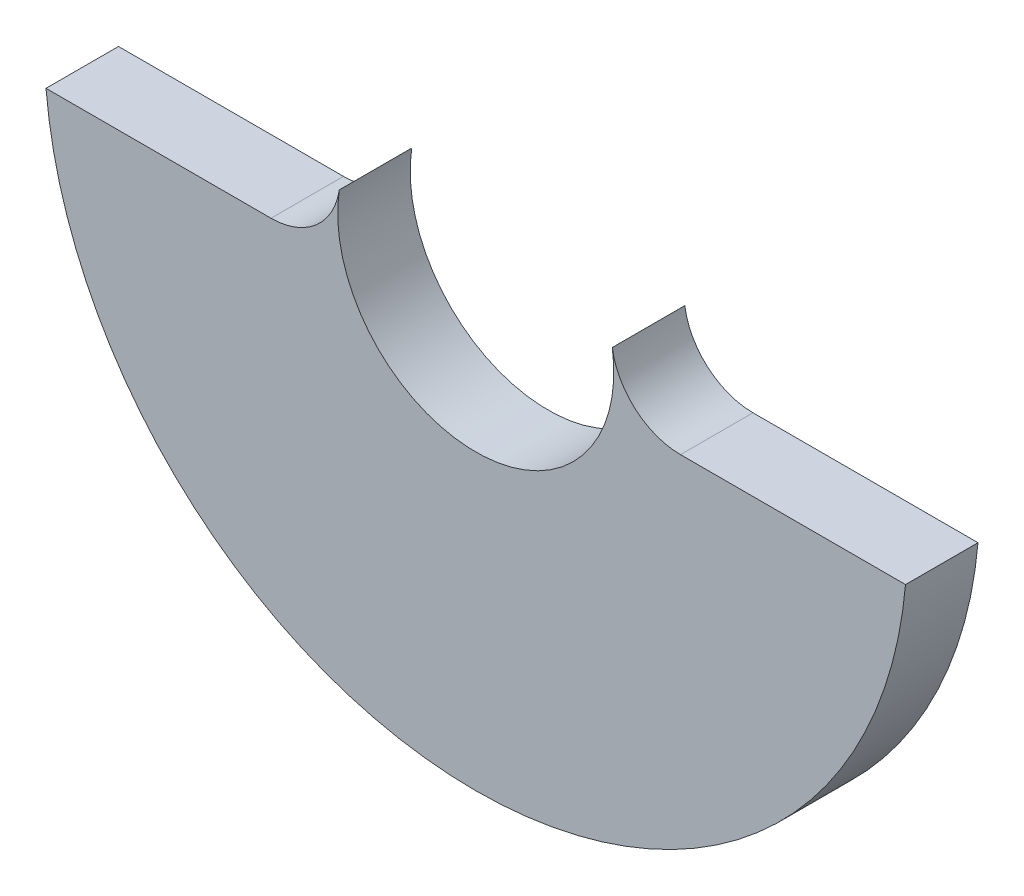
ISO-10303-21;
HEADER;
FILE_DESCRIPTION(('STEP AP214'),'2;1');
FILE_NAME('part.step','',(''),(''),'','','');
FILE_SCHEMA(('AUTOMOTIVE_DESIGN { 1 0 10303 214 1 1 1 1 }'));
ENDSEC;
DATA;
#1=APPLICATION_CONTEXT('core data for automotive mechanical design processes');
#2=APPLICATION_PROTOCOL_DEFINITION('international standard','automotive_design',2000,#1);
#3=PRODUCT_CONTEXT('',#1,'mechanical');
#4=PRODUCT('Part','Part','',(#3));
#5=PRODUCT_RELATED_PRODUCT_CATEGORY('part','',(#4));
#6=PRODUCT_DEFINITION_FORMATION('','',#4);
#7=PRODUCT_DEFINITION_CONTEXT('part definition',#1,'design');
#8=PRODUCT_DEFINITION('design','',#6,#7);
#9=PRODUCT_DEFINITION_SHAPE('','',#8);
#10=(LENGTH_UNIT() NAMED_UNIT(*) SI_UNIT(.MILLI.,.METRE.));
#11=(NAMED_UNIT(*) PLANE_ANGLE_UNIT() SI_UNIT($,.RADIAN.));
#12=(NAMED_UNIT(*) SI_UNIT($,.STERADIAN.) SOLID_ANGLE_UNIT());
#13=UNCERTAINTY_MEASURE_WITH_UNIT(LENGTH_MEASURE(1.E-05),#10,'distance_accuracy_value','');
#14=(GEOMETRIC_REPRESENTATION_CONTEXT(3) GLOBAL_UNCERTAINTY_ASSIGNED_CONTEXT((#13)) GLOBAL_UNIT_ASSIGNED_CONTEXT((#10,
#11,#12)) REPRESENTATION_CONTEXT('',''));
#15=CARTESIAN_POINT('',(0.,0.,0.));
#16=DIRECTION('',(0.,0.,1.));
#17=DIRECTION('',(1.,0.,0.));
#18=AXIS2_PLACEMENT_3D('',#15,#16,#17);
#19=CARTESIAN_POINT('',(-31.283198072784,-2.2,0.));
#20=DIRECTION('',(0.,-1.,0.));
#21=DIRECTION('',(0.,0.,-1.));
#22=AXIS2_PLACEMENT_3D('',#19,#20,#21);
#23=PLANE('',#22);
#24=DIRECTION('',(0.,0.,1.));
#25=VECTOR('',#24,1.);
#26=CARTESIAN_POINT('',(11.8642319599711,-2.2,0.));
#27=LINE('',#26,#25);
#28=CARTESIAN_POINT('',(11.8642319599711,-2.2,0.));
#29=VERTEX_POINT('',#28);
#30=CARTESIAN_POINT('',(11.8642319599711,-2.2,4.2));
#31=VERTEX_POINT('',#30);
#32=EDGE_CURVE('E85',#29,#31,#27,.T.);
#33=ORIENTED_EDGE('',*,*,#32,.T.);
#34=DIRECTION('',(1.,0.,0.));
#35=VECTOR('',#34,1.);
#36=CARTESIAN_POINT('',(-31.283198072784,-2.2,4.2));
#37=LINE('',#36,#35);
#38=CARTESIAN_POINT('',(24.9030118660374,-2.2,4.2));
#39=VERTEX_POINT('',#38);
#40=EDGE_CURVE('E77',#31,#39,#37,.T.);
#41=ORIENTED_EDGE('',*,*,#40,.T.);
#42=DIRECTION('',(0.,0.,-1.));
#43=VECTOR('',#42,1.);
#44=CARTESIAN_POINT('',(24.9030118660374,-2.2,4.2));
#45=LINE('',#44,#43);
#46=CARTESIAN_POINT('',(24.9030118660374,-2.2,0.));
#47=VERTEX_POINT('',#46);
#48=EDGE_CURVE('E111',#47,#39,#45,.F.);
#49=ORIENTED_EDGE('',*,*,#48,.F.);
#50=DIRECTION('',(1.,0.,0.));
#51=VECTOR('',#50,1.);
#52=CARTESIAN_POINT('',(-31.283198072784,-2.2,0.));
#53=LINE('',#52,#51);
#54=EDGE_CURVE('E39',#29,#47,#53,.T.);
#55=ORIENTED_EDGE('',*,*,#54,.F.);
#56=EDGE_LOOP('',(#33,#41,#49,#55));
#57=FACE_BOUND('',#56,.T.);
#58=ADVANCED_FACE('F24',(#57),#23,.F.);
#59=CARTESIAN_POINT('',(0.,0.,0.));
#60=DIRECTION('',(0.,0.,1.));
#61=DIRECTION('',(1.,0.,0.));
#62=AXIS2_PLACEMENT_3D('',#59,#60,#61);
#63=PLANE('',#62);
#64=CARTESIAN_POINT('',(0.,0.,0.));
#65=DIRECTION('',(0.,0.,1.));
#66=DIRECTION('',(1.,0.,0.));
#67=AXIS2_PLACEMENT_3D('',#64,#65,#66);
#68=CIRCLE('',#67,25.);
#69=CARTESIAN_POINT('',(-24.9030118660374,-2.2,0.));
#70=VERTEX_POINT('',#69);
#71=EDGE_CURVE('E32',#70,#47,#68,.T.);
#72=ORIENTED_EDGE('',*,*,#71,.F.);
#73=CARTESIAN_POINT('',(-11.8642319599711,-2.2,0.));
#74=VERTEX_POINT('',#73);
#75=EDGE_CURVE('E110',#70,#74,#53,.T.);
#76=ORIENTED_EDGE('',*,*,#75,.T.);
#77=CARTESIAN_POINT('',(-11.8642319599711,1.8,0.));
#78=DIRECTION('',(0.,0.,-1.));
#79=DIRECTION('',(1.,0.,0.));
#80=AXIS2_PLACEMENT_3D('',#77,#78,#79);
#81=CIRCLE('',#80,4.);
#82=CARTESIAN_POINT('',(-7.90948797331408,1.2,0.));
#83=VERTEX_POINT('',#82);
#84=EDGE_CURVE('E102',#83,#74,#81,.T.);
#85=ORIENTED_EDGE('',*,*,#84,.F.);
#86=CARTESIAN_POINT('',(0.,0.,0.));
#87=DIRECTION('',(0.,0.,1.));
#88=DIRECTION('',(1.,0.,0.));
#89=AXIS2_PLACEMENT_3D('',#86,#87,#88);
#90=CIRCLE('',#89,8.);
#91=CARTESIAN_POINT('',(7.90948797331408,1.2,0.));
#92=VERTEX_POINT('',#91);
#93=EDGE_CURVE('E116',#83,#92,#90,.T.);
#94=ORIENTED_EDGE('',*,*,#93,.T.);
#95=CARTESIAN_POINT('',(11.8642319599711,1.8,0.));
#96=DIRECTION('',(0.,0.,-1.));
#97=DIRECTION('',(1.,0.,0.));
#98=AXIS2_PLACEMENT_3D('',#95,#96,#97);
#99=CIRCLE('',#98,4.);
#100=EDGE_CURVE('E90',#29,#92,#99,.T.);
#101=ORIENTED_EDGE('',*,*,#100,.F.);
#102=ORIENTED_EDGE('',*,*,#54,.T.);
#103=EDGE_LOOP('',(#72,#76,#85,#94,#101,#102));
#104=FACE_BOUND('',#103,.T.);
#105=ADVANCED_FACE('F124',(#104),#63,.F.);
#106=CARTESIAN_POINT('',(0.,0.,4.2));
#107=DIRECTION('',(0.,0.,1.));
#108=DIRECTION('',(1.,0.,0.));
#109=AXIS2_PLACEMENT_3D('',#106,#107,#108);
#110=PLANE('',#109);
#111=CARTESIAN_POINT('',(-24.9030118660374,-2.2,4.2));
#112=VERTEX_POINT('',#111);
#113=CARTESIAN_POINT('',(-11.8642319599711,-2.2,4.2));
#114=VERTEX_POINT('',#113);
#115=EDGE_CURVE('E47',#112,#114,#37,.T.);
#116=ORIENTED_EDGE('',*,*,#115,.F.);
#117=CARTESIAN_POINT('',(0.,0.,4.2));
#118=DIRECTION('',(0.,0.,1.));
#119=DIRECTION('',(1.,0.,0.));
#120=AXIS2_PLACEMENT_3D('',#117,#118,#119);
#121=CIRCLE('',#120,25.);
#122=EDGE_CURVE('E11',#112,#39,#121,.T.);
#123=ORIENTED_EDGE('',*,*,#122,.T.);
#124=ORIENTED_EDGE('',*,*,#40,.F.);
#125=CARTESIAN_POINT('',(11.8642319599711,1.8,4.2));
#126=DIRECTION('',(0.,0.,-1.));
#127=DIRECTION('',(1.,0.,0.));
#128=AXIS2_PLACEMENT_3D('',#125,#126,#127);
#129=CIRCLE('',#128,4.);
#130=CARTESIAN_POINT('',(7.90948797331408,1.2,4.2));
#131=VERTEX_POINT('',#130);
#132=EDGE_CURVE('E80',#31,#131,#129,.T.);
#133=ORIENTED_EDGE('',*,*,#132,.T.);
#134=CARTESIAN_POINT('',(0.,0.,4.2));
#135=DIRECTION('',(0.,0.,1.));
#136=DIRECTION('',(1.,0.,0.));
#137=AXIS2_PLACEMENT_3D('',#134,#135,#136);
#138=CIRCLE('',#137,8.);
#139=CARTESIAN_POINT('',(-7.90948797331408,1.2,4.2));
#140=VERTEX_POINT('',#139);
#141=EDGE_CURVE('E118',#140,#131,#138,.T.);
#142=ORIENTED_EDGE('',*,*,#141,.F.);
#143=CARTESIAN_POINT('',(-11.8642319599711,1.8,4.2));
#144=DIRECTION('',(0.,0.,-1.));
#145=DIRECTION('',(1.,0.,0.));
#146=AXIS2_PLACEMENT_3D('',#143,#144,#145);
#147=CIRCLE('',#146,4.);
#148=EDGE_CURVE('E98',#140,#114,#147,.T.);
#149=ORIENTED_EDGE('',*,*,#148,.T.);
#150=EDGE_LOOP('',(#116,#123,#124,#133,#142,#149));
#151=FACE_BOUND('',#150,.T.);
#152=ADVANCED_FACE('F78',(#151),#110,.T.);
#153=CARTESIAN_POINT('',(0.,0.,4.2));
#154=DIRECTION('',(0.,0.,-1.));
#155=DIRECTION('',(-1.,0.,0.));
#156=AXIS2_PLACEMENT_3D('',#153,#154,#155);
#157=CYLINDRICAL_SURFACE('',#156,25.);
#158=ORIENTED_EDGE('',*,*,#122,.F.);
#159=DIRECTION('',(0.,0.,-1.));
#160=VECTOR('',#159,1.);
#161=CARTESIAN_POINT('',(-24.9030118660374,-2.2,4.2));
#162=LINE('',#161,#160);
#163=EDGE_CURVE('E113',#112,#70,#162,.T.);
#164=ORIENTED_EDGE('',*,*,#163,.T.);
#165=ORIENTED_EDGE('',*,*,#71,.T.);
#166=ORIENTED_EDGE('',*,*,#48,.T.);
#167=EDGE_LOOP('',(#158,#164,#165,#166));
#168=FACE_BOUND('',#167,.T.);
#169=ADVANCED_FACE('F26',(#168),#157,.T.);
#170=CARTESIAN_POINT('',(0.,0.,4.2));
#171=DIRECTION('',(0.,0.,-1.));
#172=DIRECTION('',(-1.,0.,0.));
#173=AXIS2_PLACEMENT_3D('',#170,#171,#172);
#174=CYLINDRICAL_SURFACE('',#173,8.);
#175=ORIENTED_EDGE('',*,*,#93,.F.);
#176=DIRECTION('',(0.,0.,1.));
#177=VECTOR('',#176,1.);
#178=CARTESIAN_POINT('',(-7.90948797331408,1.2,0.));
#179=LINE('',#178,#177);
#180=EDGE_CURVE('E105',#83,#140,#179,.T.);
#181=ORIENTED_EDGE('',*,*,#180,.T.);
#182=ORIENTED_EDGE('',*,*,#141,.T.);
#183=DIRECTION('',(0.,0.,1.));
#184=VECTOR('',#183,1.);
#185=CARTESIAN_POINT('',(7.90948797331408,1.2,0.));
#186=LINE('',#185,#184);
#187=EDGE_CURVE('E89',#92,#131,#186,.T.);
#188=ORIENTED_EDGE('',*,*,#187,.F.);
#189=EDGE_LOOP('',(#175,#181,#182,#188));
#190=FACE_BOUND('',#189,.T.);
#191=ADVANCED_FACE('F128',(#190),#174,.F.);
#192=ORIENTED_EDGE('',*,*,#115,.T.);
#193=DIRECTION('',(0.,0.,1.));
#194=VECTOR('',#193,1.);
#195=CARTESIAN_POINT('',(-11.8642319599711,-2.2,0.));
#196=LINE('',#195,#194);
#197=EDGE_CURVE('E83',#74,#114,#196,.T.);
#198=ORIENTED_EDGE('',*,*,#197,.F.);
#199=ORIENTED_EDGE('',*,*,#75,.F.);
#200=ORIENTED_EDGE('',*,*,#163,.F.);
#201=EDGE_LOOP('',(#192,#198,#199,#200));
#202=FACE_BOUND('',#201,.T.);
#203=ADVANCED_FACE('F132',(#202),#23,.F.);
#204=CARTESIAN_POINT('',(-11.8642319599711,1.8,0.));
#205=DIRECTION('',(0.,0.,1.));
#206=DIRECTION('',(1.,0.,0.));
#207=AXIS2_PLACEMENT_3D('',#204,#205,#206);
#208=CYLINDRICAL_SURFACE('',#207,4.);
#209=ORIENTED_EDGE('',*,*,#148,.F.);
#210=ORIENTED_EDGE('',*,*,#180,.F.);
#211=ORIENTED_EDGE('',*,*,#84,.T.);
#212=ORIENTED_EDGE('',*,*,#197,.T.);
#213=EDGE_LOOP('',(#209,#210,#211,#212));
#214=FACE_BOUND('',#213,.T.);
#215=ADVANCED_FACE('F131',(#214),#208,.F.);
#216=CARTESIAN_POINT('',(11.8642319599711,1.8,0.));
#217=DIRECTION('',(0.,0.,1.));
#218=DIRECTION('',(1.,0.,0.));
#219=AXIS2_PLACEMENT_3D('',#216,#217,#218);
#220=CYLINDRICAL_SURFACE('',#219,4.);
#221=ORIENTED_EDGE('',*,*,#132,.F.);
#222=ORIENTED_EDGE('',*,*,#32,.F.);
#223=ORIENTED_EDGE('',*,*,#100,.T.);
#224=ORIENTED_EDGE('',*,*,#187,.T.);
#225=EDGE_LOOP('',(#221,#222,#223,#224));
#226=FACE_BOUND('',#225,.T.);
#227=ADVANCED_FACE('F93',(#226),#220,.F.);
#228=CLOSED_SHELL('',(#58,#105,#152,#169,#191,#203,#215,#227));
#229=MANIFOLD_SOLID_BREP('B2',#228);
#230=ADVANCED_BREP_SHAPE_REPRESENTATION('',(#18,#229),#14);
#231=SHAPE_DEFINITION_REPRESENTATION(#9,#230);
ENDSEC;
END-ISO-10303-21;
